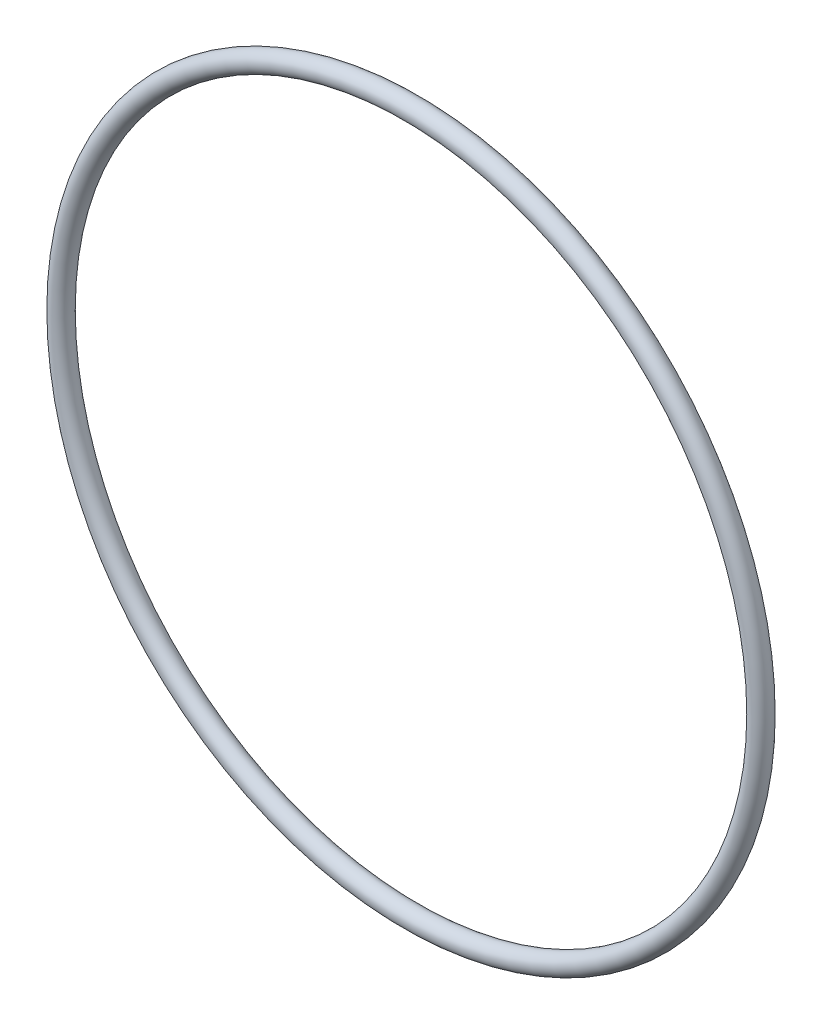
ISO-10303-21;
HEADER;
FILE_DESCRIPTION(('STEP AP214'),'2;1');
FILE_NAME('part.step','',(''),(''),'','','');
FILE_SCHEMA(('AUTOMOTIVE_DESIGN { 1 0 10303 214 1 1 1 1 }'));
ENDSEC;
DATA;
#1=APPLICATION_CONTEXT('core data for automotive mechanical design processes');
#2=APPLICATION_PROTOCOL_DEFINITION('international standard','automotive_design',2000,#1);
#3=PRODUCT_CONTEXT('',#1,'mechanical');
#4=PRODUCT('Part','Part','',(#3));
#5=PRODUCT_RELATED_PRODUCT_CATEGORY('part','',(#4));
#6=PRODUCT_DEFINITION_FORMATION('','',#4);
#7=PRODUCT_DEFINITION_CONTEXT('part definition',#1,'design');
#8=PRODUCT_DEFINITION('design','',#6,#7);
#9=PRODUCT_DEFINITION_SHAPE('','',#8);
#10=(LENGTH_UNIT() NAMED_UNIT(*) SI_UNIT(.MILLI.,.METRE.));
#11=(NAMED_UNIT(*) PLANE_ANGLE_UNIT() SI_UNIT($,.RADIAN.));
#12=(NAMED_UNIT(*) SI_UNIT($,.STERADIAN.) SOLID_ANGLE_UNIT());
#13=UNCERTAINTY_MEASURE_WITH_UNIT(LENGTH_MEASURE(1.E-05),#10,'distance_accuracy_value','');
#14=(GEOMETRIC_REPRESENTATION_CONTEXT(3) GLOBAL_UNCERTAINTY_ASSIGNED_CONTEXT((#13)) GLOBAL_UNIT_ASSIGNED_CONTEXT((#10,
#11,#12)) REPRESENTATION_CONTEXT('',''));
#15=CARTESIAN_POINT('',(0.,0.,0.));
#16=DIRECTION('',(0.,0.,1.));
#17=DIRECTION('',(1.,0.,0.));
#18=AXIS2_PLACEMENT_3D('',#15,#16,#17);
#19=CARTESIAN_POINT('',(0.,0.,0.));
#20=DIRECTION('',(0.,0.,1.));
#21=DIRECTION('',(1.,0.,0.));
#22=AXIS2_PLACEMENT_3D('',#19,#20,#21);
#23=TOROIDAL_SURFACE('',#22,55.245,1.5875);
#24=CARTESIAN_POINT('',(55.245,0.,0.));
#25=DIRECTION('',(0.,1.,0.));
#26=DIRECTION('',(-1.,0.,0.));
#27=AXIS2_PLACEMENT_3D('',#24,#25,#26);
#28=CIRCLE('',#27,1.5875);
#29=CARTESIAN_POINT('',(56.8325,0.,0.));
#30=VERTEX_POINT('',#29);
#31=EDGE_CURVE('E11',#30,#30,#28,.T.);
#32=CARTESIAN_POINT('',(0.,0.,0.));
#33=DIRECTION('',(0.,0.,1.));
#34=DIRECTION('',(1.,0.,0.));
#35=AXIS2_PLACEMENT_3D('',#32,#33,#34);
#36=CIRCLE('',#35,56.8325);
#37=EDGE_CURVE('',#30,#30,#36,.T.);
#38=ORIENTED_EDGE('',*,*,#31,.T.);
#39=ORIENTED_EDGE('',*,*,#31,.F.);
#40=ORIENTED_EDGE('',*,*,#37,.T.);
#41=ORIENTED_EDGE('',*,*,#37,.F.);
#42=EDGE_LOOP('',(#38,#40,#39,#41));
#43=FACE_BOUND('',#42,.T.);
#44=ADVANCED_FACE('F48',(#43),#23,.T.);
#45=CLOSED_SHELL('',(#44));
#46=MANIFOLD_SOLID_BREP('B2',#45);
#47=ADVANCED_BREP_SHAPE_REPRESENTATION('',(#18,#46),#14);
#48=SHAPE_DEFINITION_REPRESENTATION(#9,#47);
ENDSEC;
END-ISO-10303-21;
